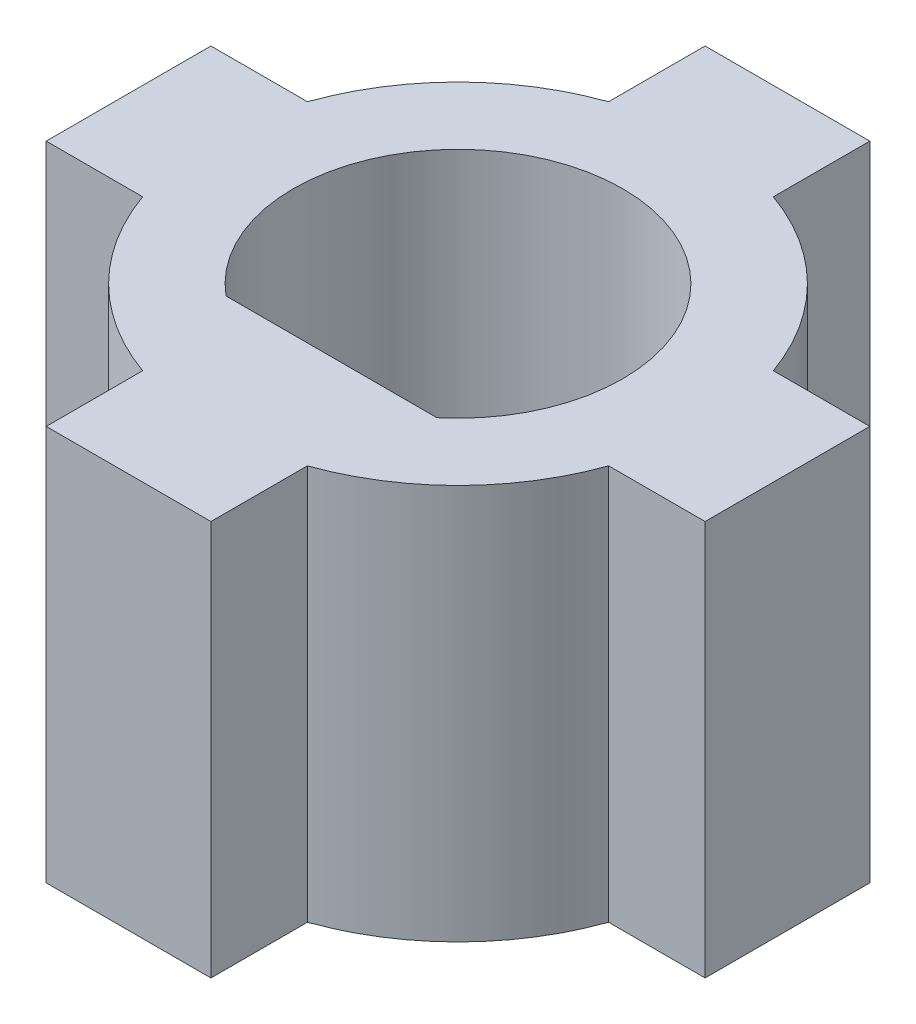
ISO-10303-21;
HEADER;
FILE_DESCRIPTION(('STEP AP214'),'2;1');
FILE_NAME('part.step','',(''),(''),'','','');
FILE_SCHEMA(('AUTOMOTIVE_DESIGN { 1 0 10303 214 1 1 1 1 }'));
ENDSEC;
DATA;
#1=APPLICATION_CONTEXT('core data for automotive mechanical design processes');
#2=APPLICATION_PROTOCOL_DEFINITION('international standard','automotive_design',2000,#1);
#3=PRODUCT_CONTEXT('',#1,'mechanical');
#4=PRODUCT('Part','Part','',(#3));
#5=PRODUCT_RELATED_PRODUCT_CATEGORY('part','',(#4));
#6=PRODUCT_DEFINITION_FORMATION('','',#4);
#7=PRODUCT_DEFINITION_CONTEXT('part definition',#1,'design');
#8=PRODUCT_DEFINITION('design','',#6,#7);
#9=PRODUCT_DEFINITION_SHAPE('','',#8);
#10=(LENGTH_UNIT() NAMED_UNIT(*) SI_UNIT(.MILLI.,.METRE.));
#11=(NAMED_UNIT(*) PLANE_ANGLE_UNIT() SI_UNIT($,.RADIAN.));
#12=(NAMED_UNIT(*) SI_UNIT($,.STERADIAN.) SOLID_ANGLE_UNIT());
#13=UNCERTAINTY_MEASURE_WITH_UNIT(LENGTH_MEASURE(1.E-05),#10,'distance_accuracy_value','');
#14=(GEOMETRIC_REPRESENTATION_CONTEXT(3) GLOBAL_UNCERTAINTY_ASSIGNED_CONTEXT((#13)) GLOBAL_UNIT_ASSIGNED_CONTEXT((#10,
#11,#12)) REPRESENTATION_CONTEXT('',''));
#15=CARTESIAN_POINT('',(0.,0.,0.));
#16=DIRECTION('',(0.,0.,1.));
#17=DIRECTION('',(1.,0.,0.));
#18=AXIS2_PLACEMENT_3D('',#15,#16,#17);
#19=CARTESIAN_POINT('',(0.,7.62,0.));
#20=DIRECTION('',(0.,-1.,0.));
#21=DIRECTION('',(0.,0.,-1.));
#22=AXIS2_PLACEMENT_3D('',#19,#20,#21);
#23=CYLINDRICAL_SURFACE('',#22,4.7625);
#24=CARTESIAN_POINT('',(0.,0.,0.));
#25=DIRECTION('',(0.,1.,0.));
#26=DIRECTION('',(0.,0.,1.));
#27=AXIS2_PLACEMENT_3D('',#24,#25,#26);
#28=CIRCLE('',#27,4.7625);
#29=CARTESIAN_POINT('',(-4.49012806053458,0.,1.5875));
#30=VERTEX_POINT('',#29);
#31=CARTESIAN_POINT('',(-1.5875,0.,4.49012806053458));
#32=VERTEX_POINT('',#31);
#33=EDGE_CURVE('E217',#30,#32,#28,.T.);
#34=ORIENTED_EDGE('',*,*,#33,.T.);
#35=DIRECTION('',(0.,-1.,0.));
#36=VECTOR('',#35,1.);
#37=CARTESIAN_POINT('',(-1.5875,7.62,4.49012806053458));
#38=LINE('',#37,#36);
#39=CARTESIAN_POINT('',(-1.5875,7.62,4.49012806053458));
#40=VERTEX_POINT('',#39);
#41=EDGE_CURVE('E11',#40,#32,#38,.T.);
#42=ORIENTED_EDGE('',*,*,#41,.F.);
#43=CARTESIAN_POINT('',(0.,7.62,0.));
#44=DIRECTION('',(0.,1.,0.));
#45=DIRECTION('',(0.,0.,1.));
#46=AXIS2_PLACEMENT_3D('',#43,#44,#45);
#47=CIRCLE('',#46,4.7625);
#48=CARTESIAN_POINT('',(-4.49012806053458,7.62,1.5875));
#49=VERTEX_POINT('',#48);
#50=EDGE_CURVE('E398',#49,#40,#47,.T.);
#51=ORIENTED_EDGE('',*,*,#50,.F.);
#52=DIRECTION('',(0.,-1.,0.));
#53=VECTOR('',#52,1.);
#54=CARTESIAN_POINT('',(-4.49012806053458,7.62,1.5875));
#55=LINE('',#54,#53);
#56=EDGE_CURVE('E61',#49,#30,#55,.T.);
#57=ORIENTED_EDGE('',*,*,#56,.T.);
#58=EDGE_LOOP('',(#34,#42,#51,#57));
#59=FACE_BOUND('',#58,.T.);
#60=ADVANCED_FACE('F41',(#59),#23,.T.);
#61=CARTESIAN_POINT('',(-1.5875,7.62,0.));
#62=DIRECTION('',(1.,0.,0.));
#63=DIRECTION('',(0.,0.,-1.));
#64=AXIS2_PLACEMENT_3D('',#61,#62,#63);
#65=PLANE('',#64);
#66=DIRECTION('',(0.,0.,1.));
#67=VECTOR('',#66,1.);
#68=CARTESIAN_POINT('',(-1.5875,0.,0.));
#69=LINE('',#68,#67);
#70=CARTESIAN_POINT('',(-1.5875,0.,6.35));
#71=VERTEX_POINT('',#70);
#72=EDGE_CURVE('E220',#32,#71,#69,.T.);
#73=ORIENTED_EDGE('',*,*,#72,.T.);
#74=DIRECTION('',(0.,-1.,0.));
#75=VECTOR('',#74,1.);
#76=CARTESIAN_POINT('',(-1.5875,7.62,6.35));
#77=LINE('',#76,#75);
#78=CARTESIAN_POINT('',(-1.5875,7.62,6.35));
#79=VERTEX_POINT('',#78);
#80=EDGE_CURVE('E52',#79,#71,#77,.T.);
#81=ORIENTED_EDGE('',*,*,#80,.F.);
#82=DIRECTION('',(0.,0.,1.));
#83=VECTOR('',#82,1.);
#84=CARTESIAN_POINT('',(-1.5875,7.62,0.));
#85=LINE('',#84,#83);
#86=EDGE_CURVE('E403',#40,#79,#85,.T.);
#87=ORIENTED_EDGE('',*,*,#86,.F.);
#88=ORIENTED_EDGE('',*,*,#41,.T.);
#89=EDGE_LOOP('',(#73,#81,#87,#88));
#90=FACE_BOUND('',#89,.T.);
#91=ADVANCED_FACE('F333',(#90),#65,.F.);
#92=CARTESIAN_POINT('',(0.,7.62,6.35));
#93=DIRECTION('',(0.,0.,1.));
#94=DIRECTION('',(1.,0.,0.));
#95=AXIS2_PLACEMENT_3D('',#92,#93,#94);
#96=PLANE('',#95);
#97=DIRECTION('',(-1.,0.,0.));
#98=VECTOR('',#97,1.);
#99=CARTESIAN_POINT('',(0.,0.,6.35));
#100=LINE('',#99,#98);
#101=CARTESIAN_POINT('',(1.5875,0.,6.35));
#102=VERTEX_POINT('',#101);
#103=EDGE_CURVE('E224',#102,#71,#100,.T.);
#104=ORIENTED_EDGE('',*,*,#103,.F.);
#105=DIRECTION('',(0.,-1.,0.));
#106=VECTOR('',#105,1.);
#107=CARTESIAN_POINT('',(1.5875,7.62,6.35));
#108=LINE('',#107,#106);
#109=CARTESIAN_POINT('',(1.5875,7.62,6.35));
#110=VERTEX_POINT('',#109);
#111=EDGE_CURVE('E310',#110,#102,#108,.T.);
#112=ORIENTED_EDGE('',*,*,#111,.F.);
#113=DIRECTION('',(-1.,0.,0.));
#114=VECTOR('',#113,1.);
#115=CARTESIAN_POINT('',(0.,7.62,6.35));
#116=LINE('',#115,#114);
#117=EDGE_CURVE('E406',#110,#79,#116,.T.);
#118=ORIENTED_EDGE('',*,*,#117,.T.);
#119=ORIENTED_EDGE('',*,*,#80,.T.);
#120=EDGE_LOOP('',(#104,#112,#118,#119));
#121=FACE_BOUND('',#120,.T.);
#122=ADVANCED_FACE('F338',(#121),#96,.T.);
#123=CARTESIAN_POINT('',(1.5875,7.62,0.));
#124=DIRECTION('',(1.,0.,0.));
#125=DIRECTION('',(0.,0.,-1.));
#126=AXIS2_PLACEMENT_3D('',#123,#124,#125);
#127=PLANE('',#126);
#128=DIRECTION('',(0.,0.,1.));
#129=VECTOR('',#128,1.);
#130=CARTESIAN_POINT('',(1.5875,0.,0.));
#131=LINE('',#130,#129);
#132=CARTESIAN_POINT('',(1.5875,0.,4.49012806053458));
#133=VERTEX_POINT('',#132);
#134=EDGE_CURVE('E228',#133,#102,#131,.T.);
#135=ORIENTED_EDGE('',*,*,#134,.F.);
#136=DIRECTION('',(0.,-1.,0.));
#137=VECTOR('',#136,1.);
#138=CARTESIAN_POINT('',(1.5875,7.62,4.49012806053458));
#139=LINE('',#138,#137);
#140=CARTESIAN_POINT('',(1.5875,7.62,4.49012806053458));
#141=VERTEX_POINT('',#140);
#142=EDGE_CURVE('E307',#141,#133,#139,.T.);
#143=ORIENTED_EDGE('',*,*,#142,.F.);
#144=DIRECTION('',(0.,0.,1.));
#145=VECTOR('',#144,1.);
#146=CARTESIAN_POINT('',(1.5875,7.62,0.));
#147=LINE('',#146,#145);
#148=EDGE_CURVE('E410',#141,#110,#147,.T.);
#149=ORIENTED_EDGE('',*,*,#148,.T.);
#150=ORIENTED_EDGE('',*,*,#111,.T.);
#151=EDGE_LOOP('',(#135,#143,#149,#150));
#152=FACE_BOUND('',#151,.T.);
#153=ADVANCED_FACE('F344',(#152),#127,.T.);
#154=CARTESIAN_POINT('',(0.,7.62,0.));
#155=DIRECTION('',(0.,-1.,0.));
#156=DIRECTION('',(0.,0.,-1.));
#157=AXIS2_PLACEMENT_3D('',#154,#155,#156);
#158=CYLINDRICAL_SURFACE('',#157,4.7625);
#159=CARTESIAN_POINT('',(0.,0.,0.));
#160=DIRECTION('',(0.,1.,0.));
#161=DIRECTION('',(0.,0.,1.));
#162=AXIS2_PLACEMENT_3D('',#159,#160,#161);
#163=CIRCLE('',#162,4.7625);
#164=CARTESIAN_POINT('',(4.49012806053458,0.,1.5875));
#165=VERTEX_POINT('',#164);
#166=EDGE_CURVE('E232',#133,#165,#163,.T.);
#167=ORIENTED_EDGE('',*,*,#166,.T.);
#168=DIRECTION('',(0.,-1.,0.));
#169=VECTOR('',#168,1.);
#170=CARTESIAN_POINT('',(4.49012806053458,7.62,1.5875));
#171=LINE('',#170,#169);
#172=CARTESIAN_POINT('',(4.49012806053458,7.62,1.5875));
#173=VERTEX_POINT('',#172);
#174=EDGE_CURVE('E303',#173,#165,#171,.T.);
#175=ORIENTED_EDGE('',*,*,#174,.F.);
#176=CARTESIAN_POINT('',(0.,7.62,0.));
#177=DIRECTION('',(0.,1.,0.));
#178=DIRECTION('',(0.,0.,1.));
#179=AXIS2_PLACEMENT_3D('',#176,#177,#178);
#180=CIRCLE('',#179,4.7625);
#181=EDGE_CURVE('E414',#141,#173,#180,.T.);
#182=ORIENTED_EDGE('',*,*,#181,.F.);
#183=ORIENTED_EDGE('',*,*,#142,.T.);
#184=EDGE_LOOP('',(#167,#175,#182,#183));
#185=FACE_BOUND('',#184,.T.);
#186=ADVANCED_FACE('F348',(#185),#158,.T.);
#187=CARTESIAN_POINT('',(0.,7.62,1.5875));
#188=DIRECTION('',(0.,0.,-1.));
#189=DIRECTION('',(-1.,0.,0.));
#190=AXIS2_PLACEMENT_3D('',#187,#188,#189);
#191=PLANE('',#190);
#192=DIRECTION('',(1.,0.,0.));
#193=VECTOR('',#192,1.);
#194=CARTESIAN_POINT('',(0.,0.,1.5875));
#195=LINE('',#194,#193);
#196=CARTESIAN_POINT('',(6.35,0.,1.5875));
#197=VERTEX_POINT('',#196);
#198=EDGE_CURVE('E235',#165,#197,#195,.T.);
#199=ORIENTED_EDGE('',*,*,#198,.T.);
#200=DIRECTION('',(0.,-1.,0.));
#201=VECTOR('',#200,1.);
#202=CARTESIAN_POINT('',(6.35,7.62,1.5875));
#203=LINE('',#202,#201);
#204=CARTESIAN_POINT('',(6.35,7.62,1.5875));
#205=VERTEX_POINT('',#204);
#206=EDGE_CURVE('E299',#205,#197,#203,.T.);
#207=ORIENTED_EDGE('',*,*,#206,.F.);
#208=DIRECTION('',(1.,0.,0.));
#209=VECTOR('',#208,1.);
#210=CARTESIAN_POINT('',(0.,7.62,1.5875));
#211=LINE('',#210,#209);
#212=EDGE_CURVE('E417',#173,#205,#211,.T.);
#213=ORIENTED_EDGE('',*,*,#212,.F.);
#214=ORIENTED_EDGE('',*,*,#174,.T.);
#215=EDGE_LOOP('',(#199,#207,#213,#214));
#216=FACE_BOUND('',#215,.T.);
#217=ADVANCED_FACE('F352',(#216),#191,.F.);
#218=CARTESIAN_POINT('',(6.35,7.62,0.));
#219=DIRECTION('',(-1.,0.,0.));
#220=DIRECTION('',(0.,0.,1.));
#221=AXIS2_PLACEMENT_3D('',#218,#219,#220);
#222=PLANE('',#221);
#223=DIRECTION('',(0.,0.,-1.));
#224=VECTOR('',#223,1.);
#225=CARTESIAN_POINT('',(6.35,0.,0.));
#226=LINE('',#225,#224);
#227=CARTESIAN_POINT('',(6.35,0.,-1.5875));
#228=VERTEX_POINT('',#227);
#229=EDGE_CURVE('E238',#197,#228,#226,.T.);
#230=ORIENTED_EDGE('',*,*,#229,.T.);
#231=DIRECTION('',(0.,-1.,0.));
#232=VECTOR('',#231,1.);
#233=CARTESIAN_POINT('',(6.35,7.62,-1.5875));
#234=LINE('',#233,#232);
#235=CARTESIAN_POINT('',(6.35,7.62,-1.5875));
#236=VERTEX_POINT('',#235);
#237=EDGE_CURVE('E296',#236,#228,#234,.T.);
#238=ORIENTED_EDGE('',*,*,#237,.F.);
#239=DIRECTION('',(0.,0.,-1.));
#240=VECTOR('',#239,1.);
#241=CARTESIAN_POINT('',(6.35,7.62,0.));
#242=LINE('',#241,#240);
#243=EDGE_CURVE('E420',#205,#236,#242,.T.);
#244=ORIENTED_EDGE('',*,*,#243,.F.);
#245=ORIENTED_EDGE('',*,*,#206,.T.);
#246=EDGE_LOOP('',(#230,#238,#244,#245));
#247=FACE_BOUND('',#246,.T.);
#248=ADVANCED_FACE('F356',(#247),#222,.F.);
#249=CARTESIAN_POINT('',(0.,7.62,-1.5875));
#250=DIRECTION('',(0.,0.,-1.));
#251=DIRECTION('',(-1.,0.,0.));
#252=AXIS2_PLACEMENT_3D('',#249,#250,#251);
#253=PLANE('',#252);
#254=DIRECTION('',(1.,0.,0.));
#255=VECTOR('',#254,1.);
#256=CARTESIAN_POINT('',(0.,0.,-1.5875));
#257=LINE('',#256,#255);
#258=CARTESIAN_POINT('',(4.49012806053458,0.,-1.5875));
#259=VERTEX_POINT('',#258);
#260=EDGE_CURVE('E242',#259,#228,#257,.T.);
#261=ORIENTED_EDGE('',*,*,#260,.F.);
#262=DIRECTION('',(0.,-1.,0.));
#263=VECTOR('',#262,1.);
#264=CARTESIAN_POINT('',(4.49012806053458,7.62,-1.5875));
#265=LINE('',#264,#263);
#266=CARTESIAN_POINT('',(4.49012806053458,7.62,-1.5875));
#267=VERTEX_POINT('',#266);
#268=EDGE_CURVE('E293',#267,#259,#265,.T.);
#269=ORIENTED_EDGE('',*,*,#268,.F.);
#270=DIRECTION('',(1.,0.,0.));
#271=VECTOR('',#270,1.);
#272=CARTESIAN_POINT('',(0.,7.62,-1.5875));
#273=LINE('',#272,#271);
#274=EDGE_CURVE('E423',#267,#236,#273,.T.);
#275=ORIENTED_EDGE('',*,*,#274,.T.);
#276=ORIENTED_EDGE('',*,*,#237,.T.);
#277=EDGE_LOOP('',(#261,#269,#275,#276));
#278=FACE_BOUND('',#277,.T.);
#279=ADVANCED_FACE('F360',(#278),#253,.T.);
#280=CARTESIAN_POINT('',(0.,7.62,0.));
#281=DIRECTION('',(0.,-1.,0.));
#282=DIRECTION('',(0.,0.,-1.));
#283=AXIS2_PLACEMENT_3D('',#280,#281,#282);
#284=CYLINDRICAL_SURFACE('',#283,4.7625);
#285=CARTESIAN_POINT('',(0.,0.,0.));
#286=DIRECTION('',(0.,1.,0.));
#287=DIRECTION('',(0.,0.,1.));
#288=AXIS2_PLACEMENT_3D('',#285,#286,#287);
#289=CIRCLE('',#288,4.7625);
#290=CARTESIAN_POINT('',(1.5875,0.,-4.49012806053458));
#291=VERTEX_POINT('',#290);
#292=EDGE_CURVE('E246',#259,#291,#289,.T.);
#293=ORIENTED_EDGE('',*,*,#292,.T.);
#294=DIRECTION('',(0.,-1.,0.));
#295=VECTOR('',#294,1.);
#296=CARTESIAN_POINT('',(1.5875,7.62,-4.49012806053458));
#297=LINE('',#296,#295);
#298=CARTESIAN_POINT('',(1.5875,7.62,-4.49012806053458));
#299=VERTEX_POINT('',#298);
#300=EDGE_CURVE('E289',#299,#291,#297,.T.);
#301=ORIENTED_EDGE('',*,*,#300,.F.);
#302=CARTESIAN_POINT('',(0.,7.62,0.));
#303=DIRECTION('',(0.,1.,0.));
#304=DIRECTION('',(0.,0.,1.));
#305=AXIS2_PLACEMENT_3D('',#302,#303,#304);
#306=CIRCLE('',#305,4.7625);
#307=EDGE_CURVE('E427',#267,#299,#306,.T.);
#308=ORIENTED_EDGE('',*,*,#307,.F.);
#309=ORIENTED_EDGE('',*,*,#268,.T.);
#310=EDGE_LOOP('',(#293,#301,#308,#309));
#311=FACE_BOUND('',#310,.T.);
#312=ADVANCED_FACE('F364',(#311),#284,.T.);
#313=CARTESIAN_POINT('',(1.5875,7.62,0.));
#314=DIRECTION('',(-1.,0.,0.));
#315=DIRECTION('',(0.,0.,1.));
#316=AXIS2_PLACEMENT_3D('',#313,#314,#315);
#317=PLANE('',#316);
#318=DIRECTION('',(0.,0.,-1.));
#319=VECTOR('',#318,1.);
#320=CARTESIAN_POINT('',(1.5875,0.,0.));
#321=LINE('',#320,#319);
#322=CARTESIAN_POINT('',(1.5875,0.,-6.35));
#323=VERTEX_POINT('',#322);
#324=EDGE_CURVE('E249',#291,#323,#321,.T.);
#325=ORIENTED_EDGE('',*,*,#324,.T.);
#326=DIRECTION('',(0.,-1.,0.));
#327=VECTOR('',#326,1.);
#328=CARTESIAN_POINT('',(1.5875,7.62,-6.35));
#329=LINE('',#328,#327);
#330=CARTESIAN_POINT('',(1.5875,7.62,-6.35));
#331=VERTEX_POINT('',#330);
#332=EDGE_CURVE('E285',#331,#323,#329,.T.);
#333=ORIENTED_EDGE('',*,*,#332,.F.);
#334=DIRECTION('',(0.,0.,-1.));
#335=VECTOR('',#334,1.);
#336=CARTESIAN_POINT('',(1.5875,7.62,0.));
#337=LINE('',#336,#335);
#338=EDGE_CURVE('E430',#299,#331,#337,.T.);
#339=ORIENTED_EDGE('',*,*,#338,.F.);
#340=ORIENTED_EDGE('',*,*,#300,.T.);
#341=EDGE_LOOP('',(#325,#333,#339,#340));
#342=FACE_BOUND('',#341,.T.);
#343=ADVANCED_FACE('F368',(#342),#317,.F.);
#344=CARTESIAN_POINT('',(0.,7.62,-6.35));
#345=DIRECTION('',(0.,0.,1.));
#346=DIRECTION('',(1.,0.,0.));
#347=AXIS2_PLACEMENT_3D('',#344,#345,#346);
#348=PLANE('',#347);
#349=DIRECTION('',(-1.,0.,0.));
#350=VECTOR('',#349,1.);
#351=CARTESIAN_POINT('',(0.,0.,-6.35));
#352=LINE('',#351,#350);
#353=CARTESIAN_POINT('',(-1.5875,0.,-6.35));
#354=VERTEX_POINT('',#353);
#355=EDGE_CURVE('E252',#323,#354,#352,.T.);
#356=ORIENTED_EDGE('',*,*,#355,.T.);
#357=DIRECTION('',(0.,-1.,0.));
#358=VECTOR('',#357,1.);
#359=CARTESIAN_POINT('',(-1.5875,7.62,-6.35));
#360=LINE('',#359,#358);
#361=CARTESIAN_POINT('',(-1.5875,7.62,-6.35));
#362=VERTEX_POINT('',#361);
#363=EDGE_CURVE('E282',#362,#354,#360,.T.);
#364=ORIENTED_EDGE('',*,*,#363,.F.);
#365=DIRECTION('',(-1.,0.,0.));
#366=VECTOR('',#365,1.);
#367=CARTESIAN_POINT('',(0.,7.62,-6.35));
#368=LINE('',#367,#366);
#369=EDGE_CURVE('E433',#331,#362,#368,.T.);
#370=ORIENTED_EDGE('',*,*,#369,.F.);
#371=ORIENTED_EDGE('',*,*,#332,.T.);
#372=EDGE_LOOP('',(#356,#364,#370,#371));
#373=FACE_BOUND('',#372,.T.);
#374=ADVANCED_FACE('F372',(#373),#348,.F.);
#375=CARTESIAN_POINT('',(-1.5875,7.62,0.));
#376=DIRECTION('',(-1.,0.,0.));
#377=DIRECTION('',(0.,0.,1.));
#378=AXIS2_PLACEMENT_3D('',#375,#376,#377);
#379=PLANE('',#378);
#380=DIRECTION('',(0.,0.,-1.));
#381=VECTOR('',#380,1.);
#382=CARTESIAN_POINT('',(-1.5875,0.,0.));
#383=LINE('',#382,#381);
#384=CARTESIAN_POINT('',(-1.5875,0.,-4.49012806053458));
#385=VERTEX_POINT('',#384);
#386=EDGE_CURVE('E256',#385,#354,#383,.T.);
#387=ORIENTED_EDGE('',*,*,#386,.F.);
#388=DIRECTION('',(0.,-1.,0.));
#389=VECTOR('',#388,1.);
#390=CARTESIAN_POINT('',(-1.5875,7.62,-4.49012806053458));
#391=LINE('',#390,#389);
#392=CARTESIAN_POINT('',(-1.5875,7.62,-4.49012806053458));
#393=VERTEX_POINT('',#392);
#394=EDGE_CURVE('E279',#393,#385,#391,.T.);
#395=ORIENTED_EDGE('',*,*,#394,.F.);
#396=DIRECTION('',(0.,0.,-1.));
#397=VECTOR('',#396,1.);
#398=CARTESIAN_POINT('',(-1.5875,7.62,0.));
#399=LINE('',#398,#397);
#400=EDGE_CURVE('E436',#393,#362,#399,.T.);
#401=ORIENTED_EDGE('',*,*,#400,.T.);
#402=ORIENTED_EDGE('',*,*,#363,.T.);
#403=EDGE_LOOP('',(#387,#395,#401,#402));
#404=FACE_BOUND('',#403,.T.);
#405=ADVANCED_FACE('F376',(#404),#379,.T.);
#406=CARTESIAN_POINT('',(0.,7.62,0.));
#407=DIRECTION('',(0.,-1.,0.));
#408=DIRECTION('',(0.,0.,-1.));
#409=AXIS2_PLACEMENT_3D('',#406,#407,#408);
#410=CYLINDRICAL_SURFACE('',#409,4.7625);
#411=CARTESIAN_POINT('',(0.,0.,0.));
#412=DIRECTION('',(0.,1.,0.));
#413=DIRECTION('',(0.,0.,1.));
#414=AXIS2_PLACEMENT_3D('',#411,#412,#413);
#415=CIRCLE('',#414,4.7625);
#416=CARTESIAN_POINT('',(-4.49012806053458,0.,-1.5875));
#417=VERTEX_POINT('',#416);
#418=EDGE_CURVE('E260',#385,#417,#415,.T.);
#419=ORIENTED_EDGE('',*,*,#418,.T.);
#420=DIRECTION('',(0.,-1.,0.));
#421=VECTOR('',#420,1.);
#422=CARTESIAN_POINT('',(-4.49012806053458,7.62,-1.5875));
#423=LINE('',#422,#421);
#424=CARTESIAN_POINT('',(-4.49012806053458,7.62,-1.5875));
#425=VERTEX_POINT('',#424);
#426=EDGE_CURVE('E198',#425,#417,#423,.T.);
#427=ORIENTED_EDGE('',*,*,#426,.F.);
#428=CARTESIAN_POINT('',(0.,7.62,0.));
#429=DIRECTION('',(0.,1.,0.));
#430=DIRECTION('',(0.,0.,1.));
#431=AXIS2_PLACEMENT_3D('',#428,#429,#430);
#432=CIRCLE('',#431,4.7625);
#433=EDGE_CURVE('E184',#393,#425,#432,.T.);
#434=ORIENTED_EDGE('',*,*,#433,.F.);
#435=ORIENTED_EDGE('',*,*,#394,.T.);
#436=EDGE_LOOP('',(#419,#427,#434,#435));
#437=FACE_BOUND('',#436,.T.);
#438=ADVANCED_FACE('F380',(#437),#410,.T.);
#439=CARTESIAN_POINT('',(0.,7.62,-1.5875));
#440=DIRECTION('',(0.,0.,1.));
#441=DIRECTION('',(1.,0.,0.));
#442=AXIS2_PLACEMENT_3D('',#439,#440,#441);
#443=PLANE('',#442);
#444=DIRECTION('',(-1.,0.,0.));
#445=VECTOR('',#444,1.);
#446=CARTESIAN_POINT('',(0.,0.,-1.5875));
#447=LINE('',#446,#445);
#448=CARTESIAN_POINT('',(-6.35,0.,-1.5875));
#449=VERTEX_POINT('',#448);
#450=EDGE_CURVE('E194',#417,#449,#447,.T.);
#451=ORIENTED_EDGE('',*,*,#450,.T.);
#452=DIRECTION('',(0.,-1.,0.));
#453=VECTOR('',#452,1.);
#454=CARTESIAN_POINT('',(-6.35,7.62,-1.5875));
#455=LINE('',#454,#453);
#456=CARTESIAN_POINT('',(-6.35,7.62,-1.5875));
#457=VERTEX_POINT('',#456);
#458=EDGE_CURVE('E191',#457,#449,#455,.T.);
#459=ORIENTED_EDGE('',*,*,#458,.F.);
#460=DIRECTION('',(-1.,0.,0.));
#461=VECTOR('',#460,1.);
#462=CARTESIAN_POINT('',(0.,7.62,-1.5875));
#463=LINE('',#462,#461);
#464=EDGE_CURVE('E175',#425,#457,#463,.T.);
#465=ORIENTED_EDGE('',*,*,#464,.F.);
#466=ORIENTED_EDGE('',*,*,#426,.T.);
#467=EDGE_LOOP('',(#451,#459,#465,#466));
#468=FACE_BOUND('',#467,.T.);
#469=ADVANCED_FACE('F192',(#468),#443,.F.);
#470=CARTESIAN_POINT('',(-6.35,7.62,0.));
#471=DIRECTION('',(1.,0.,0.));
#472=DIRECTION('',(0.,0.,-1.));
#473=AXIS2_PLACEMENT_3D('',#470,#471,#472);
#474=PLANE('',#473);
#475=DIRECTION('',(0.,0.,1.));
#476=VECTOR('',#475,1.);
#477=CARTESIAN_POINT('',(-6.35,0.,0.));
#478=LINE('',#477,#476);
#479=CARTESIAN_POINT('',(-6.35,0.,1.5875));
#480=VERTEX_POINT('',#479);
#481=EDGE_CURVE('E265',#449,#480,#478,.T.);
#482=ORIENTED_EDGE('',*,*,#481,.T.);
#483=DIRECTION('',(0.,-1.,0.));
#484=VECTOR('',#483,1.);
#485=CARTESIAN_POINT('',(-6.35,7.62,1.5875));
#486=LINE('',#485,#484);
#487=CARTESIAN_POINT('',(-6.35,7.62,1.5875));
#488=VERTEX_POINT('',#487);
#489=EDGE_CURVE('E118',#488,#480,#486,.T.);
#490=ORIENTED_EDGE('',*,*,#489,.F.);
#491=DIRECTION('',(0.,0.,1.));
#492=VECTOR('',#491,1.);
#493=CARTESIAN_POINT('',(-6.35,7.62,0.));
#494=LINE('',#493,#492);
#495=EDGE_CURVE('E181',#457,#488,#494,.T.);
#496=ORIENTED_EDGE('',*,*,#495,.F.);
#497=ORIENTED_EDGE('',*,*,#458,.T.);
#498=EDGE_LOOP('',(#482,#490,#496,#497));
#499=FACE_BOUND('',#498,.T.);
#500=ADVANCED_FACE('F200',(#499),#474,.F.);
#501=CARTESIAN_POINT('',(0.,7.62,0.));
#502=DIRECTION('',(0.,-1.,0.));
#503=DIRECTION('',(0.,0.,-1.));
#504=AXIS2_PLACEMENT_3D('',#501,#502,#503);
#505=CYLINDRICAL_SURFACE('',#504,3.175);
#506=CARTESIAN_POINT('',(0.,0.,0.));
#507=DIRECTION('',(0.,1.,0.));
#508=DIRECTION('',(0.,0.,1.));
#509=AXIS2_PLACEMENT_3D('',#506,#507,#508);
#510=CIRCLE('',#509,3.175);
#511=CARTESIAN_POINT('',(2.032,0.,2.43959033446192));
#512=VERTEX_POINT('',#511);
#513=CARTESIAN_POINT('',(-2.032,0.,2.43959033446192));
#514=VERTEX_POINT('',#513);
#515=EDGE_CURVE('E209',#512,#514,#510,.T.);
#516=ORIENTED_EDGE('',*,*,#515,.F.);
#517=DIRECTION('',(0.,-1.,0.));
#518=VECTOR('',#517,1.);
#519=CARTESIAN_POINT('',(2.032,7.62,2.43959033446192));
#520=LINE('',#519,#518);
#521=CARTESIAN_POINT('',(2.032,7.62,2.43959033446192));
#522=VERTEX_POINT('',#521);
#523=EDGE_CURVE('E45',#522,#512,#520,.T.);
#524=ORIENTED_EDGE('',*,*,#523,.F.);
#525=CARTESIAN_POINT('',(0.,7.62,0.));
#526=DIRECTION('',(0.,1.,0.));
#527=DIRECTION('',(0.,0.,1.));
#528=AXIS2_PLACEMENT_3D('',#525,#526,#527);
#529=CIRCLE('',#528,3.175);
#530=CARTESIAN_POINT('',(-2.032,7.62,2.43959033446192));
#531=VERTEX_POINT('',#530);
#532=EDGE_CURVE('E272',#522,#531,#529,.T.);
#533=ORIENTED_EDGE('',*,*,#532,.T.);
#534=DIRECTION('',(0.,-1.,0.));
#535=VECTOR('',#534,1.);
#536=CARTESIAN_POINT('',(-2.032,7.62,2.43959033446192));
#537=LINE('',#536,#535);
#538=EDGE_CURVE('E205',#531,#514,#537,.T.);
#539=ORIENTED_EDGE('',*,*,#538,.T.);
#540=EDGE_LOOP('',(#516,#524,#533,#539));
#541=FACE_BOUND('',#540,.T.);
#542=ADVANCED_FACE('F43',(#541),#505,.F.);
#543=CARTESIAN_POINT('',(0.,7.62,2.43959033446192));
#544=DIRECTION('',(0.,0.,1.));
#545=DIRECTION('',(1.,0.,0.));
#546=AXIS2_PLACEMENT_3D('',#543,#544,#545);
#547=PLANE('',#546);
#548=DIRECTION('',(-1.,0.,0.));
#549=VECTOR('',#548,1.);
#550=CARTESIAN_POINT('',(0.,0.,2.43959033446192));
#551=LINE('',#550,#549);
#552=EDGE_CURVE('E213',#512,#514,#551,.T.);
#553=ORIENTED_EDGE('',*,*,#552,.T.);
#554=ORIENTED_EDGE('',*,*,#538,.F.);
#555=DIRECTION('',(-1.,0.,0.));
#556=VECTOR('',#555,1.);
#557=CARTESIAN_POINT('',(0.,7.62,2.43959033446192));
#558=LINE('',#557,#556);
#559=EDGE_CURVE('E320',#522,#531,#558,.T.);
#560=ORIENTED_EDGE('',*,*,#559,.F.);
#561=ORIENTED_EDGE('',*,*,#523,.T.);
#562=EDGE_LOOP('',(#553,#554,#560,#561));
#563=FACE_BOUND('',#562,.T.);
#564=ADVANCED_FACE('F319',(#563),#547,.F.);
#565=CARTESIAN_POINT('',(0.,7.62,1.5875));
#566=DIRECTION('',(0.,0.,1.));
#567=DIRECTION('',(1.,0.,0.));
#568=AXIS2_PLACEMENT_3D('',#565,#566,#567);
#569=PLANE('',#568);
#570=DIRECTION('',(-1.,0.,0.));
#571=VECTOR('',#570,1.);
#572=CARTESIAN_POINT('',(0.,0.,1.5875));
#573=LINE('',#572,#571);
#574=EDGE_CURVE('E268',#30,#480,#573,.T.);
#575=ORIENTED_EDGE('',*,*,#574,.F.);
#576=ORIENTED_EDGE('',*,*,#56,.F.);
#577=DIRECTION('',(-1.,0.,0.));
#578=VECTOR('',#577,1.);
#579=CARTESIAN_POINT('',(0.,7.62,1.5875));
#580=LINE('',#579,#578);
#581=EDGE_CURVE('E202',#49,#488,#580,.T.);
#582=ORIENTED_EDGE('',*,*,#581,.T.);
#583=ORIENTED_EDGE('',*,*,#489,.T.);
#584=EDGE_LOOP('',(#575,#576,#582,#583));
#585=FACE_BOUND('',#584,.T.);
#586=ADVANCED_FACE('F330',(#585),#569,.T.);
#587=CARTESIAN_POINT('',(0.,7.62,0.));
#588=DIRECTION('',(0.,1.,0.));
#589=DIRECTION('',(0.,0.,1.));
#590=AXIS2_PLACEMENT_3D('',#587,#588,#589);
#591=PLANE('',#590);
#592=ORIENTED_EDGE('',*,*,#532,.F.);
#593=ORIENTED_EDGE('',*,*,#559,.T.);
#594=EDGE_LOOP('',(#592,#593));
#595=FACE_BOUND('',#594,.T.);
#596=ORIENTED_EDGE('',*,*,#50,.T.);
#597=ORIENTED_EDGE('',*,*,#86,.T.);
#598=ORIENTED_EDGE('',*,*,#117,.F.);
#599=ORIENTED_EDGE('',*,*,#148,.F.);
#600=ORIENTED_EDGE('',*,*,#181,.T.);
#601=ORIENTED_EDGE('',*,*,#212,.T.);
#602=ORIENTED_EDGE('',*,*,#243,.T.);
#603=ORIENTED_EDGE('',*,*,#274,.F.);
#604=ORIENTED_EDGE('',*,*,#307,.T.);
#605=ORIENTED_EDGE('',*,*,#338,.T.);
#606=ORIENTED_EDGE('',*,*,#369,.T.);
#607=ORIENTED_EDGE('',*,*,#400,.F.);
#608=ORIENTED_EDGE('',*,*,#433,.T.);
#609=ORIENTED_EDGE('',*,*,#464,.T.);
#610=ORIENTED_EDGE('',*,*,#495,.T.);
#611=ORIENTED_EDGE('',*,*,#581,.F.);
#612=EDGE_LOOP('',(#596,#597,#598,#599,#600,#601,#602,#603,#604,#605,#606,#607,#608,#609,#610,#611));
#613=FACE_BOUND('',#612,.T.);
#614=ADVANCED_FACE('F178',(#595,#613),#591,.T.);
#615=CARTESIAN_POINT('',(0.,0.,0.));
#616=DIRECTION('',(0.,1.,0.));
#617=DIRECTION('',(0.,0.,1.));
#618=AXIS2_PLACEMENT_3D('',#615,#616,#617);
#619=PLANE('',#618);
#620=ORIENTED_EDGE('',*,*,#515,.T.);
#621=ORIENTED_EDGE('',*,*,#552,.F.);
#622=EDGE_LOOP('',(#620,#621));
#623=FACE_BOUND('',#622,.T.);
#624=ORIENTED_EDGE('',*,*,#33,.F.);
#625=ORIENTED_EDGE('',*,*,#574,.T.);
#626=ORIENTED_EDGE('',*,*,#481,.F.);
#627=ORIENTED_EDGE('',*,*,#450,.F.);
#628=ORIENTED_EDGE('',*,*,#418,.F.);
#629=ORIENTED_EDGE('',*,*,#386,.T.);
#630=ORIENTED_EDGE('',*,*,#355,.F.);
#631=ORIENTED_EDGE('',*,*,#324,.F.);
#632=ORIENTED_EDGE('',*,*,#292,.F.);
#633=ORIENTED_EDGE('',*,*,#260,.T.);
#634=ORIENTED_EDGE('',*,*,#229,.F.);
#635=ORIENTED_EDGE('',*,*,#198,.F.);
#636=ORIENTED_EDGE('',*,*,#166,.F.);
#637=ORIENTED_EDGE('',*,*,#134,.T.);
#638=ORIENTED_EDGE('',*,*,#103,.T.);
#639=ORIENTED_EDGE('',*,*,#72,.F.);
#640=EDGE_LOOP('',(#624,#625,#626,#627,#628,#629,#630,#631,#632,#633,#634,#635,#636,#637,#638,#639));
#641=FACE_BOUND('',#640,.T.);
#642=ADVANCED_FACE('F323',(#623,#641),#619,.F.);
#643=CLOSED_SHELL('',(#60,#91,#122,#153,#186,#217,#248,#279,#312,#343,#374,#405,#438,#469,#500,
#542,#564,#586,#614,#642));
#644=MANIFOLD_SOLID_BREP('B2',#643);
#645=ADVANCED_BREP_SHAPE_REPRESENTATION('',(#18,#644),#14);
#646=SHAPE_DEFINITION_REPRESENTATION(#9,#645);
ENDSEC;
END-ISO-10303-21;
